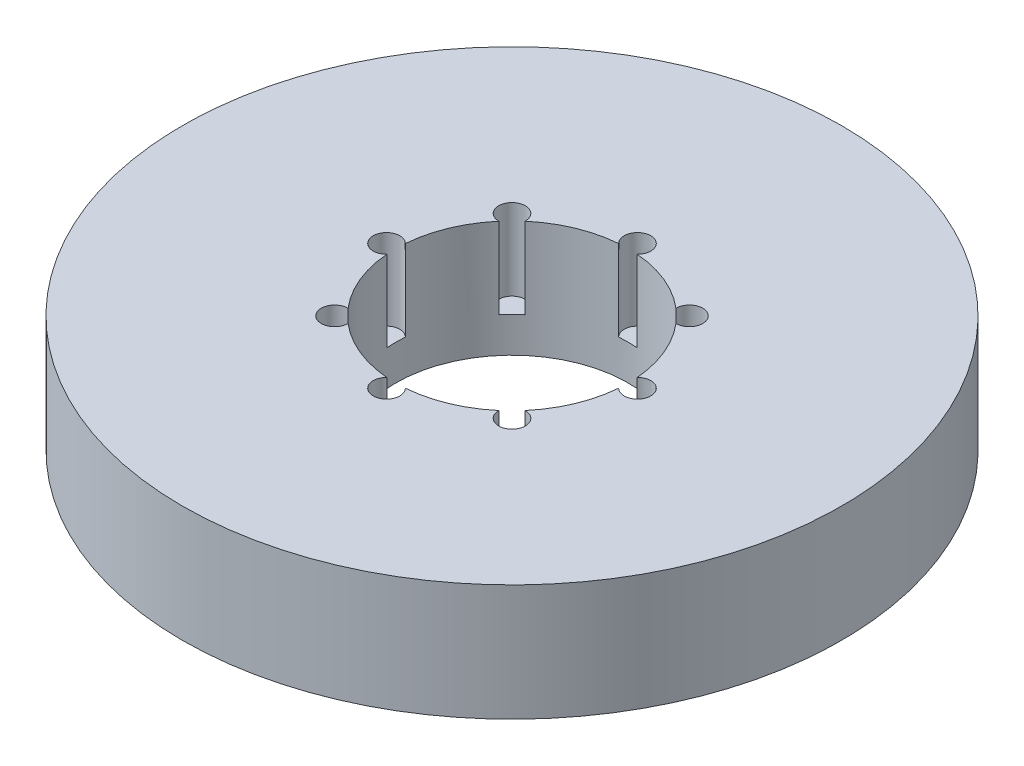
ISO-10303-21;
HEADER;
FILE_DESCRIPTION(('STEP AP214'),'2;1');
FILE_NAME('part.step','',(''),(''),'','','');
FILE_SCHEMA(('AUTOMOTIVE_DESIGN { 1 0 10303 214 1 1 1 1 }'));
ENDSEC;
DATA;
#1=APPLICATION_CONTEXT('core data for automotive mechanical design processes');
#2=APPLICATION_PROTOCOL_DEFINITION('international standard','automotive_design',2000,#1);
#3=PRODUCT_CONTEXT('',#1,'mechanical');
#4=PRODUCT('Part','Part','',(#3));
#5=PRODUCT_RELATED_PRODUCT_CATEGORY('part','',(#4));
#6=PRODUCT_DEFINITION_FORMATION('','',#4);
#7=PRODUCT_DEFINITION_CONTEXT('part definition',#1,'design');
#8=PRODUCT_DEFINITION('design','',#6,#7);
#9=PRODUCT_DEFINITION_SHAPE('','',#8);
#10=(LENGTH_UNIT() NAMED_UNIT(*) SI_UNIT(.MILLI.,.METRE.));
#11=(NAMED_UNIT(*) PLANE_ANGLE_UNIT() SI_UNIT($,.RADIAN.));
#12=(NAMED_UNIT(*) SI_UNIT($,.STERADIAN.) SOLID_ANGLE_UNIT());
#13=UNCERTAINTY_MEASURE_WITH_UNIT(LENGTH_MEASURE(1.E-05),#10,'distance_accuracy_value','');
#14=(GEOMETRIC_REPRESENTATION_CONTEXT(3) GLOBAL_UNCERTAINTY_ASSIGNED_CONTEXT((#13)) GLOBAL_UNIT_ASSIGNED_CONTEXT((#10,
#11,#12)) REPRESENTATION_CONTEXT('',''));
#15=CARTESIAN_POINT('',(0.,0.,0.));
#16=DIRECTION('',(0.,0.,1.));
#17=DIRECTION('',(1.,0.,0.));
#18=AXIS2_PLACEMENT_3D('',#15,#16,#17);
#19=CARTESIAN_POINT('',(0.,30.,0.));
#20=DIRECTION('',(0.,-1.,0.));
#21=DIRECTION('',(0.,0.,-1.));
#22=AXIS2_PLACEMENT_3D('',#19,#20,#21);
#23=CYLINDRICAL_SURFACE('',#22,85.);
#24=CARTESIAN_POINT('',(0.,30.,0.));
#25=DIRECTION('',(0.,1.,0.));
#26=DIRECTION('',(0.,0.,1.));
#27=AXIS2_PLACEMENT_3D('',#24,#25,#26);
#28=CIRCLE('',#27,85.);
#29=CARTESIAN_POINT('',(0.,30.,85.));
#30=VERTEX_POINT('',#29);
#31=EDGE_CURVE('E195',#30,#30,#28,.T.);
#32=ORIENTED_EDGE('',*,*,#31,.F.);
#33=EDGE_LOOP('',(#32));
#34=FACE_BOUND('',#33,.T.);
#35=CARTESIAN_POINT('',(0.,0.,0.));
#36=DIRECTION('',(0.,1.,0.));
#37=DIRECTION('',(0.,0.,1.));
#38=AXIS2_PLACEMENT_3D('',#35,#36,#37);
#39=CIRCLE('',#38,85.);
#40=CARTESIAN_POINT('',(0.,0.,85.));
#41=VERTEX_POINT('',#40);
#42=EDGE_CURVE('E179',#41,#41,#39,.T.);
#43=ORIENTED_EDGE('',*,*,#42,.T.);
#44=EDGE_LOOP('',(#43));
#45=FACE_BOUND('',#44,.T.);
#46=ADVANCED_FACE('F39',(#34,#45),#23,.T.);
#47=CARTESIAN_POINT('',(0.,30.,0.));
#48=DIRECTION('',(0.,1.,0.));
#49=DIRECTION('',(0.,0.,1.));
#50=AXIS2_PLACEMENT_3D('',#47,#48,#49);
#51=PLANE('',#50);
#52=CARTESIAN_POINT('',(1.13000187914397E-13,30.,32.3645401329394));
#53=DIRECTION('',(0.,1.,0.));
#54=DIRECTION('',(1.,0.,0.));
#55=AXIS2_PLACEMENT_3D('',#52,#53,#54);
#56=CIRCLE('',#55,3.43145850614087);
#57=CARTESIAN_POINT('',(-2.39226681175299,30.,29.9044655444866));
#58=VERTEX_POINT('',#57);
#59=CARTESIAN_POINT('',(2.3922668117532,30.,29.9044655444866));
#60=VERTEX_POINT('',#59);
#61=EDGE_CURVE('E176',#58,#60,#56,.T.);
#62=ORIENTED_EDGE('',*,*,#61,.F.);
#63=CARTESIAN_POINT('',(0.,30.,0.));
#64=DIRECTION('',(0.,1.,0.));
#65=DIRECTION('',(0.,0.,1.));
#66=AXIS2_PLACEMENT_3D('',#63,#64,#65);
#67=CIRCLE('',#66,30.);
#68=CARTESIAN_POINT('',(-19.4540622892677,30.,22.8372384592641));
#69=VERTEX_POINT('',#68);
#70=EDGE_CURVE('E166',#69,#58,#67,.T.);
#71=ORIENTED_EDGE('',*,*,#70,.F.);
#72=CARTESIAN_POINT('',(-22.8851857979856,30.,22.8851857979856));
#73=DIRECTION('',(0.,1.,0.));
#74=DIRECTION('',(0.707106781186549,0.,0.707106781186546));
#75=AXIS2_PLACEMENT_3D('',#72,#73,#74);
#76=CIRCLE('',#75,3.43145850614087);
#77=CARTESIAN_POINT('',(-22.837238459264,30.,19.4540622892678));
#78=VERTEX_POINT('',#77);
#79=EDGE_CURVE('E147',#78,#69,#76,.T.);
#80=ORIENTED_EDGE('',*,*,#79,.F.);
#81=CARTESIAN_POINT('',(-29.9044655444866,30.,2.3922668117531));
#82=VERTEX_POINT('',#81);
#83=EDGE_CURVE('E180',#82,#78,#67,.T.);
#84=ORIENTED_EDGE('',*,*,#83,.F.);
#85=CARTESIAN_POINT('',(-32.3645401329394,30.,0.));
#86=DIRECTION('',(0.,1.,0.));
#87=DIRECTION('',(0.,0.,1.));
#88=AXIS2_PLACEMENT_3D('',#85,#86,#87);
#89=CIRCLE('',#88,3.43145850614087);
#90=CARTESIAN_POINT('',(-29.9044655444866,30.,-2.3922668117531));
#91=VERTEX_POINT('',#90);
#92=EDGE_CURVE('E186',#91,#82,#89,.T.);
#93=ORIENTED_EDGE('',*,*,#92,.F.);
#94=CARTESIAN_POINT('',(-22.8372384592643,30.,-19.4540622892675));
#95=VERTEX_POINT('',#94);
#96=EDGE_CURVE('E182',#95,#91,#67,.T.);
#97=ORIENTED_EDGE('',*,*,#96,.F.);
#98=CARTESIAN_POINT('',(-22.8851857979859,30.,-22.8851857979853));
#99=DIRECTION('',(0.,1.,0.));
#100=DIRECTION('',(-0.707106781186539,0.,0.707106781186556));
#101=AXIS2_PLACEMENT_3D('',#98,#99,#100);
#102=CIRCLE('',#101,3.43145850614087);
#103=CARTESIAN_POINT('',(-19.4540622892681,30.,-22.8372384592638));
#104=VERTEX_POINT('',#103);
#105=EDGE_CURVE('E446',#104,#95,#102,.T.);
#106=ORIENTED_EDGE('',*,*,#105,.F.);
#107=CARTESIAN_POINT('',(-2.39226681175341,30.,-29.9044655444865));
#108=VERTEX_POINT('',#107);
#109=EDGE_CURVE('E452',#108,#104,#67,.T.);
#110=ORIENTED_EDGE('',*,*,#109,.F.);
#111=CARTESIAN_POINT('',(-3.39000563743192E-13,30.,-32.3645401329394));
#112=DIRECTION('',(0.,1.,0.));
#113=DIRECTION('',(-1.,0.,0.));
#114=AXIS2_PLACEMENT_3D('',#111,#112,#113);
#115=CIRCLE('',#114,3.43145850614087);
#116=CARTESIAN_POINT('',(2.39226681175278,30.,-29.9044655444866));
#117=VERTEX_POINT('',#116);
#118=EDGE_CURVE('E477',#117,#108,#115,.T.);
#119=ORIENTED_EDGE('',*,*,#118,.F.);
#120=CARTESIAN_POINT('',(19.4540622892676,30.,-22.8372384592642));
#121=VERTEX_POINT('',#120);
#122=EDGE_CURVE('E460',#121,#117,#67,.T.);
#123=ORIENTED_EDGE('',*,*,#122,.F.);
#124=CARTESIAN_POINT('',(22.8851857979854,30.,-22.8851857979858));
#125=DIRECTION('',(0.,1.,0.));
#126=DIRECTION('',(-0.707106781186554,0.,-0.707106781186541));
#127=AXIS2_PLACEMENT_3D('',#124,#125,#126);
#128=CIRCLE('',#127,3.43145850614087);
#129=CARTESIAN_POINT('',(22.8372384592639,30.,-19.454062289268));
#130=VERTEX_POINT('',#129);
#131=EDGE_CURVE('E464',#130,#121,#128,.T.);
#132=ORIENTED_EDGE('',*,*,#131,.F.);
#133=CARTESIAN_POINT('',(29.9044655444866,30.,-2.3922668117531));
#134=VERTEX_POINT('',#133);
#135=EDGE_CURVE('E459',#134,#130,#67,.T.);
#136=ORIENTED_EDGE('',*,*,#135,.F.);
#137=CARTESIAN_POINT('',(32.3645401329394,30.,0.));
#138=DIRECTION('',(0.,1.,0.));
#139=DIRECTION('',(0.,0.,-1.));
#140=AXIS2_PLACEMENT_3D('',#137,#138,#139);
#141=CIRCLE('',#140,3.43145850614087);
#142=CARTESIAN_POINT('',(29.9044655444866,30.,2.3922668117531));
#143=VERTEX_POINT('',#142);
#144=EDGE_CURVE('E469',#143,#134,#141,.T.);
#145=ORIENTED_EDGE('',*,*,#144,.F.);
#146=CARTESIAN_POINT('',(22.8372384592642,30.,19.4540622892677));
#147=VERTEX_POINT('',#146);
#148=EDGE_CURVE('E181',#147,#143,#67,.T.);
#149=ORIENTED_EDGE('',*,*,#148,.F.);
#150=CARTESIAN_POINT('',(22.8851857979857,30.,22.8851857979855));
#151=DIRECTION('',(0.,1.,0.));
#152=DIRECTION('',(0.707106781186544,0.,-0.707106781186551));
#153=AXIS2_PLACEMENT_3D('',#150,#151,#152);
#154=CIRCLE('',#153,3.43145850614087);
#155=CARTESIAN_POINT('',(19.4540622892679,30.,22.837238459264));
#156=VERTEX_POINT('',#155);
#157=EDGE_CURVE('E475',#156,#147,#154,.T.);
#158=ORIENTED_EDGE('',*,*,#157,.F.);
#159=EDGE_CURVE('E177',#60,#156,#67,.T.);
#160=ORIENTED_EDGE('',*,*,#159,.F.);
#161=EDGE_LOOP('',(#62,#71,#80,#84,#93,#97,#106,#110,#119,#123,#132,#136,#145,#149,#158,#160));
#162=FACE_BOUND('',#161,.T.);
#163=ORIENTED_EDGE('',*,*,#31,.T.);
#164=EDGE_LOOP('',(#163));
#165=FACE_BOUND('',#164,.T.);
#166=ADVANCED_FACE('F172',(#162,#165),#51,.T.);
#167=CARTESIAN_POINT('',(0.,0.,0.));
#168=DIRECTION('',(0.,1.,0.));
#169=DIRECTION('',(0.,0.,1.));
#170=AXIS2_PLACEMENT_3D('',#167,#168,#169);
#171=PLANE('',#170);
#172=CARTESIAN_POINT('',(0.,0.,0.));
#173=DIRECTION('',(0.,1.,0.));
#174=DIRECTION('',(0.,0.,1.));
#175=AXIS2_PLACEMENT_3D('',#172,#173,#174);
#176=CIRCLE('',#175,30.);
#177=CARTESIAN_POINT('',(0.,0.,30.));
#178=VERTEX_POINT('',#177);
#179=EDGE_CURVE('E187',#178,#178,#176,.T.);
#180=ORIENTED_EDGE('',*,*,#179,.T.);
#181=EDGE_LOOP('',(#180));
#182=FACE_BOUND('',#181,.T.);
#183=ORIENTED_EDGE('',*,*,#42,.F.);
#184=EDGE_LOOP('',(#183));
#185=FACE_BOUND('',#184,.T.);
#186=ADVANCED_FACE('F270',(#182,#185),#171,.F.);
#187=CARTESIAN_POINT('',(0.,30.,0.));
#188=DIRECTION('',(0.,-1.,0.));
#189=DIRECTION('',(0.,0.,-1.));
#190=AXIS2_PLACEMENT_3D('',#187,#188,#189);
#191=CYLINDRICAL_SURFACE('',#190,30.);
#192=DIRECTION('',(0.,1.,0.));
#193=VECTOR('',#192,1.);
#194=CARTESIAN_POINT('',(-2.392266811753,19.5467976115902,29.9044655444866));
#195=LINE('',#194,#193);
#196=CARTESIAN_POINT('',(-2.39226681175299,9.09359522318038,29.9044655444866));
#197=VERTEX_POINT('',#196);
#198=EDGE_CURVE('E11',#197,#58,#195,.T.);
#199=ORIENTED_EDGE('',*,*,#198,.F.);
#200=CARTESIAN_POINT('',(0.,9.09359522318038,0.));
#201=DIRECTION('',(0.,1.,0.));
#202=DIRECTION('',(0.,0.,1.));
#203=AXIS2_PLACEMENT_3D('',#200,#201,#202);
#204=CIRCLE('',#203,30.);
#205=CARTESIAN_POINT('',(2.3922668117532,9.09359522318038,29.9044655444866));
#206=VERTEX_POINT('',#205);
#207=EDGE_CURVE('E250',#197,#206,#204,.T.);
#208=ORIENTED_EDGE('',*,*,#207,.T.);
#209=DIRECTION('',(0.,1.,0.));
#210=VECTOR('',#209,1.);
#211=CARTESIAN_POINT('',(2.39226681175321,19.5467976115902,29.9044655444866));
#212=LINE('',#211,#210);
#213=EDGE_CURVE('E46',#60,#206,#212,.F.);
#214=ORIENTED_EDGE('',*,*,#213,.F.);
#215=ORIENTED_EDGE('',*,*,#159,.T.);
#216=DIRECTION('',(0.,1.,0.));
#217=VECTOR('',#216,1.);
#218=CARTESIAN_POINT('',(19.4540622892679,19.5467976115902,22.837238459264));
#219=LINE('',#218,#217);
#220=CARTESIAN_POINT('',(19.4540622892679,9.09359522318038,22.837238459264));
#221=VERTEX_POINT('',#220);
#222=EDGE_CURVE('E244',#221,#156,#219,.T.);
#223=ORIENTED_EDGE('',*,*,#222,.F.);
#224=CARTESIAN_POINT('',(0.,9.09359522318038,0.));
#225=DIRECTION('',(0.,1.,0.));
#226=DIRECTION('',(0.,0.,1.));
#227=AXIS2_PLACEMENT_3D('',#224,#225,#226);
#228=CIRCLE('',#227,30.);
#229=CARTESIAN_POINT('',(22.8372384592642,9.09359522318038,19.4540622892677));
#230=VERTEX_POINT('',#229);
#231=EDGE_CURVE('E238',#221,#230,#228,.T.);
#232=ORIENTED_EDGE('',*,*,#231,.T.);
#233=DIRECTION('',(0.,1.,0.));
#234=VECTOR('',#233,1.);
#235=CARTESIAN_POINT('',(22.8372384592642,19.5467976115902,19.4540622892677));
#236=LINE('',#235,#234);
#237=EDGE_CURVE('E242',#147,#230,#236,.F.);
#238=ORIENTED_EDGE('',*,*,#237,.F.);
#239=ORIENTED_EDGE('',*,*,#148,.T.);
#240=DIRECTION('',(0.,1.,0.));
#241=VECTOR('',#240,1.);
#242=CARTESIAN_POINT('',(29.9044655444866,19.5467976115902,2.3922668117531));
#243=LINE('',#242,#241);
#244=CARTESIAN_POINT('',(29.9044655444866,9.09359522318038,2.3922668117531));
#245=VERTEX_POINT('',#244);
#246=EDGE_CURVE('E236',#245,#143,#243,.T.);
#247=ORIENTED_EDGE('',*,*,#246,.F.);
#248=CARTESIAN_POINT('',(0.,9.09359522318038,0.));
#249=DIRECTION('',(0.,1.,0.));
#250=DIRECTION('',(0.,0.,1.));
#251=AXIS2_PLACEMENT_3D('',#248,#249,#250);
#252=CIRCLE('',#251,30.);
#253=CARTESIAN_POINT('',(29.9044655444866,9.09359522318038,-2.3922668117531));
#254=VERTEX_POINT('',#253);
#255=EDGE_CURVE('E235',#245,#254,#252,.T.);
#256=ORIENTED_EDGE('',*,*,#255,.T.);
#257=DIRECTION('',(0.,1.,0.));
#258=VECTOR('',#257,1.);
#259=CARTESIAN_POINT('',(29.9044655444866,19.5467976115902,-2.3922668117531));
#260=LINE('',#259,#258);
#261=EDGE_CURVE('E234',#134,#254,#260,.F.);
#262=ORIENTED_EDGE('',*,*,#261,.F.);
#263=ORIENTED_EDGE('',*,*,#135,.T.);
#264=DIRECTION('',(0.,1.,0.));
#265=VECTOR('',#264,1.);
#266=CARTESIAN_POINT('',(22.8372384592639,19.5467976115902,-19.454062289268));
#267=LINE('',#266,#265);
#268=CARTESIAN_POINT('',(22.8372384592639,9.09359522318038,-19.454062289268));
#269=VERTEX_POINT('',#268);
#270=EDGE_CURVE('E229',#269,#130,#267,.T.);
#271=ORIENTED_EDGE('',*,*,#270,.F.);
#272=CARTESIAN_POINT('',(0.,9.09359522318038,0.));
#273=DIRECTION('',(0.,1.,0.));
#274=DIRECTION('',(0.,0.,1.));
#275=AXIS2_PLACEMENT_3D('',#272,#273,#274);
#276=CIRCLE('',#275,30.);
#277=CARTESIAN_POINT('',(19.4540622892676,9.09359522318038,-22.8372384592642));
#278=VERTEX_POINT('',#277);
#279=EDGE_CURVE('E221',#269,#278,#276,.T.);
#280=ORIENTED_EDGE('',*,*,#279,.T.);
#281=DIRECTION('',(0.,1.,0.));
#282=VECTOR('',#281,1.);
#283=CARTESIAN_POINT('',(19.4540622892676,19.5467976115902,-22.8372384592642));
#284=LINE('',#283,#282);
#285=EDGE_CURVE('E230',#121,#278,#284,.F.);
#286=ORIENTED_EDGE('',*,*,#285,.F.);
#287=ORIENTED_EDGE('',*,*,#122,.T.);
#288=DIRECTION('',(0.,1.,0.));
#289=VECTOR('',#288,1.);
#290=CARTESIAN_POINT('',(2.39226681175279,19.5467976115902,-29.9044655444866));
#291=LINE('',#290,#289);
#292=CARTESIAN_POINT('',(2.39226681175278,9.09359522318038,-29.9044655444866));
#293=VERTEX_POINT('',#292);
#294=EDGE_CURVE('E225',#293,#117,#291,.T.);
#295=ORIENTED_EDGE('',*,*,#294,.F.);
#296=CARTESIAN_POINT('',(0.,9.09359522318038,0.));
#297=DIRECTION('',(0.,1.,0.));
#298=DIRECTION('',(0.,0.,1.));
#299=AXIS2_PLACEMENT_3D('',#296,#297,#298);
#300=CIRCLE('',#299,30.);
#301=CARTESIAN_POINT('',(-2.39226681175341,9.09359522318038,-29.9044655444865));
#302=VERTEX_POINT('',#301);
#303=EDGE_CURVE('E216',#293,#302,#300,.T.);
#304=ORIENTED_EDGE('',*,*,#303,.T.);
#305=DIRECTION('',(0.,1.,0.));
#306=VECTOR('',#305,1.);
#307=CARTESIAN_POINT('',(-2.39226681175342,19.5467976115902,-29.9044655444866));
#308=LINE('',#307,#306);
#309=EDGE_CURVE('E218',#108,#302,#308,.F.);
#310=ORIENTED_EDGE('',*,*,#309,.F.);
#311=ORIENTED_EDGE('',*,*,#109,.T.);
#312=DIRECTION('',(0.,1.,0.));
#313=VECTOR('',#312,1.);
#314=CARTESIAN_POINT('',(-19.4540622892681,19.5467976115902,-22.8372384592638));
#315=LINE('',#314,#313);
#316=CARTESIAN_POINT('',(-19.4540622892681,9.09359522318038,-22.8372384592638));
#317=VERTEX_POINT('',#316);
#318=EDGE_CURVE('E212',#317,#104,#315,.T.);
#319=ORIENTED_EDGE('',*,*,#318,.F.);
#320=CARTESIAN_POINT('',(0.,9.09359522318038,0.));
#321=DIRECTION('',(0.,1.,0.));
#322=DIRECTION('',(0.,0.,1.));
#323=AXIS2_PLACEMENT_3D('',#320,#321,#322);
#324=CIRCLE('',#323,30.);
#325=CARTESIAN_POINT('',(-22.8372384592643,9.09359522318038,-19.4540622892675));
#326=VERTEX_POINT('',#325);
#327=EDGE_CURVE('E208',#317,#326,#324,.T.);
#328=ORIENTED_EDGE('',*,*,#327,.T.);
#329=DIRECTION('',(0.,1.,0.));
#330=VECTOR('',#329,1.);
#331=CARTESIAN_POINT('',(-22.8372384592643,19.5467976115902,-19.4540622892675));
#332=LINE('',#331,#330);
#333=EDGE_CURVE('E211',#95,#326,#332,.F.);
#334=ORIENTED_EDGE('',*,*,#333,.F.);
#335=ORIENTED_EDGE('',*,*,#96,.T.);
#336=DIRECTION('',(0.,1.,0.));
#337=VECTOR('',#336,1.);
#338=CARTESIAN_POINT('',(-29.9044655444866,19.5467976115902,-2.3922668117531));
#339=LINE('',#338,#337);
#340=CARTESIAN_POINT('',(-29.9044655444866,9.09359522318038,-2.3922668117531));
#341=VERTEX_POINT('',#340);
#342=EDGE_CURVE('E201',#341,#91,#339,.T.);
#343=ORIENTED_EDGE('',*,*,#342,.F.);
#344=CARTESIAN_POINT('',(0.,9.09359522318038,0.));
#345=DIRECTION('',(0.,1.,0.));
#346=DIRECTION('',(0.,0.,1.));
#347=AXIS2_PLACEMENT_3D('',#344,#345,#346);
#348=CIRCLE('',#347,30.);
#349=CARTESIAN_POINT('',(-29.9044655444866,9.09359522318038,2.3922668117531));
#350=VERTEX_POINT('',#349);
#351=EDGE_CURVE('E194',#341,#350,#348,.T.);
#352=ORIENTED_EDGE('',*,*,#351,.T.);
#353=DIRECTION('',(0.,1.,0.));
#354=VECTOR('',#353,1.);
#355=CARTESIAN_POINT('',(-29.9044655444866,19.5467976115902,2.3922668117531));
#356=LINE('',#355,#354);
#357=EDGE_CURVE('E199',#82,#350,#356,.F.);
#358=ORIENTED_EDGE('',*,*,#357,.F.);
#359=ORIENTED_EDGE('',*,*,#83,.T.);
#360=DIRECTION('',(0.,1.,0.));
#361=VECTOR('',#360,1.);
#362=CARTESIAN_POINT('',(-22.837238459264,19.5467976115902,19.4540622892678));
#363=LINE('',#362,#361);
#364=CARTESIAN_POINT('',(-22.837238459264,9.09359522318038,19.4540622892678));
#365=VERTEX_POINT('',#364);
#366=EDGE_CURVE('E160',#365,#78,#363,.T.);
#367=ORIENTED_EDGE('',*,*,#366,.F.);
#368=CARTESIAN_POINT('',(0.,9.09359522318038,0.));
#369=DIRECTION('',(0.,1.,0.));
#370=DIRECTION('',(0.,0.,1.));
#371=AXIS2_PLACEMENT_3D('',#368,#369,#370);
#372=CIRCLE('',#371,30.);
#373=CARTESIAN_POINT('',(-19.4540622892677,9.09359522318038,22.8372384592641));
#374=VERTEX_POINT('',#373);
#375=EDGE_CURVE('E168',#365,#374,#372,.T.);
#376=ORIENTED_EDGE('',*,*,#375,.T.);
#377=DIRECTION('',(0.,1.,0.));
#378=VECTOR('',#377,1.);
#379=CARTESIAN_POINT('',(-19.4540622892677,19.5467976115902,22.8372384592641));
#380=LINE('',#379,#378);
#381=EDGE_CURVE('E152',#69,#374,#380,.F.);
#382=ORIENTED_EDGE('',*,*,#381,.F.);
#383=ORIENTED_EDGE('',*,*,#70,.T.);
#384=EDGE_LOOP('',(#199,#208,#214,#215,#223,#232,#238,#239,#247,#256,#262,#263,#271,#280,#286,
#287,#295,#304,#310,#311,#319,#328,#334,#335,#343,#352,#358,#359,#367,#376,#382,#383));
#385=FACE_BOUND('',#384,.T.);
#386=ORIENTED_EDGE('',*,*,#179,.F.);
#387=EDGE_LOOP('',(#386));
#388=FACE_BOUND('',#387,.T.);
#389=ADVANCED_FACE('F170',(#385,#388),#191,.F.);
#390=CARTESIAN_POINT('',(-32.3645401329394,9.09359522318038,0.));
#391=DIRECTION('',(0.,1.,0.));
#392=DIRECTION('',(0.,0.,1.));
#393=AXIS2_PLACEMENT_3D('',#390,#391,#392);
#394=CYLINDRICAL_SURFACE('',#393,3.43145850614087);
#395=ORIENTED_EDGE('',*,*,#342,.T.);
#396=ORIENTED_EDGE('',*,*,#92,.T.);
#397=ORIENTED_EDGE('',*,*,#357,.T.);
#398=CARTESIAN_POINT('',(-32.3645401329394,9.09359522318038,0.));
#399=DIRECTION('',(0.,1.,0.));
#400=DIRECTION('',(0.,0.,1.));
#401=AXIS2_PLACEMENT_3D('',#398,#399,#400);
#402=CIRCLE('',#401,3.43145850614087);
#403=EDGE_CURVE('E191',#341,#350,#402,.T.);
#404=ORIENTED_EDGE('',*,*,#403,.F.);
#405=EDGE_LOOP('',(#395,#396,#397,#404));
#406=FACE_BOUND('',#405,.T.);
#407=ADVANCED_FACE('F279',(#406),#394,.F.);
#408=CARTESIAN_POINT('',(-32.3645401329394,9.09359522318038,0.));
#409=DIRECTION('',(0.,1.,0.));
#410=DIRECTION('',(0.,0.,1.));
#411=AXIS2_PLACEMENT_3D('',#408,#409,#410);
#412=PLANE('',#411);
#413=ORIENTED_EDGE('',*,*,#403,.T.);
#414=ORIENTED_EDGE('',*,*,#351,.F.);
#415=EDGE_LOOP('',(#413,#414));
#416=FACE_BOUND('',#415,.T.);
#417=ADVANCED_FACE('F285',(#416),#412,.T.);
#418=CARTESIAN_POINT('',(-22.8851857979856,9.09359522318038,22.8851857979856));
#419=DIRECTION('',(0.,1.,0.));
#420=DIRECTION('',(0.,0.,1.));
#421=AXIS2_PLACEMENT_3D('',#418,#419,#420);
#422=CYLINDRICAL_SURFACE('',#421,3.43145850614087);
#423=ORIENTED_EDGE('',*,*,#366,.T.);
#424=ORIENTED_EDGE('',*,*,#79,.T.);
#425=ORIENTED_EDGE('',*,*,#381,.T.);
#426=CARTESIAN_POINT('',(-22.8851857979856,9.09359522318038,22.8851857979856));
#427=DIRECTION('',(0.,1.,0.));
#428=DIRECTION('',(0.707106781186549,0.,0.707106781186546));
#429=AXIS2_PLACEMENT_3D('',#426,#427,#428);
#430=CIRCLE('',#429,3.43145850614087);
#431=EDGE_CURVE('E165',#365,#374,#430,.T.);
#432=ORIENTED_EDGE('',*,*,#431,.F.);
#433=EDGE_LOOP('',(#423,#424,#425,#432));
#434=FACE_BOUND('',#433,.T.);
#435=ADVANCED_FACE('F155',(#434),#422,.F.);
#436=CARTESIAN_POINT('',(-22.8851857979856,9.09359522318038,22.8851857979856));
#437=DIRECTION('',(0.,1.,0.));
#438=DIRECTION('',(0.707106781186549,0.,0.707106781186546));
#439=AXIS2_PLACEMENT_3D('',#436,#437,#438);
#440=PLANE('',#439);
#441=ORIENTED_EDGE('',*,*,#431,.T.);
#442=ORIENTED_EDGE('',*,*,#375,.F.);
#443=EDGE_LOOP('',(#441,#442));
#444=FACE_BOUND('',#443,.T.);
#445=ADVANCED_FACE('F288',(#444),#440,.T.);
#446=CARTESIAN_POINT('',(-22.8851857979859,9.09359522318038,-22.8851857979853));
#447=DIRECTION('',(0.,1.,0.));
#448=DIRECTION('',(0.,0.,1.));
#449=AXIS2_PLACEMENT_3D('',#446,#447,#448);
#450=CYLINDRICAL_SURFACE('',#449,3.43145850614087);
#451=ORIENTED_EDGE('',*,*,#318,.T.);
#452=ORIENTED_EDGE('',*,*,#105,.T.);
#453=ORIENTED_EDGE('',*,*,#333,.T.);
#454=CARTESIAN_POINT('',(-22.8851857979859,9.09359522318038,-22.8851857979853));
#455=DIRECTION('',(0.,1.,0.));
#456=DIRECTION('',(-0.707106781186539,0.,0.707106781186556));
#457=AXIS2_PLACEMENT_3D('',#454,#455,#456);
#458=CIRCLE('',#457,3.43145850614087);
#459=EDGE_CURVE('E447',#317,#326,#458,.T.);
#460=ORIENTED_EDGE('',*,*,#459,.F.);
#461=EDGE_LOOP('',(#451,#452,#453,#460));
#462=FACE_BOUND('',#461,.T.);
#463=ADVANCED_FACE('F295',(#462),#450,.F.);
#464=CARTESIAN_POINT('',(-22.8851857979859,9.09359522318038,-22.8851857979853));
#465=DIRECTION('',(0.,1.,0.));
#466=DIRECTION('',(-0.707106781186539,0.,0.707106781186556));
#467=AXIS2_PLACEMENT_3D('',#464,#465,#466);
#468=PLANE('',#467);
#469=ORIENTED_EDGE('',*,*,#459,.T.);
#470=ORIENTED_EDGE('',*,*,#327,.F.);
#471=EDGE_LOOP('',(#469,#470));
#472=FACE_BOUND('',#471,.T.);
#473=ADVANCED_FACE('F375',(#472),#468,.T.);
#474=CARTESIAN_POINT('',(-3.39000563743192E-13,9.09359522318038,-32.3645401329394));
#475=DIRECTION('',(0.,1.,0.));
#476=DIRECTION('',(0.,0.,1.));
#477=AXIS2_PLACEMENT_3D('',#474,#475,#476);
#478=CYLINDRICAL_SURFACE('',#477,3.43145850614087);
#479=ORIENTED_EDGE('',*,*,#294,.T.);
#480=ORIENTED_EDGE('',*,*,#118,.T.);
#481=ORIENTED_EDGE('',*,*,#309,.T.);
#482=CARTESIAN_POINT('',(-3.39000563743192E-13,9.09359522318038,-32.3645401329394));
#483=DIRECTION('',(0.,1.,0.));
#484=DIRECTION('',(-1.,0.,0.));
#485=AXIS2_PLACEMENT_3D('',#482,#483,#484);
#486=CIRCLE('',#485,3.43145850614087);
#487=EDGE_CURVE('E467',#293,#302,#486,.T.);
#488=ORIENTED_EDGE('',*,*,#487,.F.);
#489=EDGE_LOOP('',(#479,#480,#481,#488));
#490=FACE_BOUND('',#489,.T.);
#491=ADVANCED_FACE('F361',(#490),#478,.F.);
#492=CARTESIAN_POINT('',(-3.39000563743192E-13,9.09359522318038,-32.3645401329394));
#493=DIRECTION('',(0.,1.,0.));
#494=DIRECTION('',(-1.,0.,0.));
#495=AXIS2_PLACEMENT_3D('',#492,#493,#494);
#496=PLANE('',#495);
#497=ORIENTED_EDGE('',*,*,#487,.T.);
#498=ORIENTED_EDGE('',*,*,#303,.F.);
#499=EDGE_LOOP('',(#497,#498));
#500=FACE_BOUND('',#499,.T.);
#501=ADVANCED_FACE('F297',(#500),#496,.T.);
#502=CARTESIAN_POINT('',(22.8851857979854,9.09359522318038,-22.8851857979858));
#503=DIRECTION('',(0.,1.,0.));
#504=DIRECTION('',(0.,0.,1.));
#505=AXIS2_PLACEMENT_3D('',#502,#503,#504);
#506=CYLINDRICAL_SURFACE('',#505,3.43145850614087);
#507=ORIENTED_EDGE('',*,*,#270,.T.);
#508=ORIENTED_EDGE('',*,*,#131,.T.);
#509=ORIENTED_EDGE('',*,*,#285,.T.);
#510=CARTESIAN_POINT('',(22.8851857979854,9.09359522318038,-22.8851857979858));
#511=DIRECTION('',(0.,1.,0.));
#512=DIRECTION('',(-0.707106781186554,0.,-0.707106781186541));
#513=AXIS2_PLACEMENT_3D('',#510,#511,#512);
#514=CIRCLE('',#513,3.43145850614087);
#515=EDGE_CURVE('E470',#269,#278,#514,.T.);
#516=ORIENTED_EDGE('',*,*,#515,.F.);
#517=EDGE_LOOP('',(#507,#508,#509,#516));
#518=FACE_BOUND('',#517,.T.);
#519=ADVANCED_FACE('F294',(#518),#506,.F.);
#520=CARTESIAN_POINT('',(22.8851857979854,9.09359522318038,-22.8851857979858));
#521=DIRECTION('',(0.,1.,0.));
#522=DIRECTION('',(-0.707106781186554,0.,-0.707106781186541));
#523=AXIS2_PLACEMENT_3D('',#520,#521,#522);
#524=PLANE('',#523);
#525=ORIENTED_EDGE('',*,*,#515,.T.);
#526=ORIENTED_EDGE('',*,*,#279,.F.);
#527=EDGE_LOOP('',(#525,#526));
#528=FACE_BOUND('',#527,.T.);
#529=ADVANCED_FACE('F300',(#528),#524,.T.);
#530=CARTESIAN_POINT('',(32.3645401329394,9.09359522318038,0.));
#531=DIRECTION('',(0.,1.,0.));
#532=DIRECTION('',(0.,0.,1.));
#533=AXIS2_PLACEMENT_3D('',#530,#531,#532);
#534=CYLINDRICAL_SURFACE('',#533,3.43145850614087);
#535=ORIENTED_EDGE('',*,*,#246,.T.);
#536=ORIENTED_EDGE('',*,*,#144,.T.);
#537=ORIENTED_EDGE('',*,*,#261,.T.);
#538=CARTESIAN_POINT('',(32.3645401329394,9.09359522318038,0.));
#539=DIRECTION('',(0.,1.,0.));
#540=DIRECTION('',(0.,0.,-1.));
#541=AXIS2_PLACEMENT_3D('',#538,#539,#540);
#542=CIRCLE('',#541,3.43145850614087);
#543=EDGE_CURVE('E472',#245,#254,#542,.T.);
#544=ORIENTED_EDGE('',*,*,#543,.F.);
#545=EDGE_LOOP('',(#535,#536,#537,#544));
#546=FACE_BOUND('',#545,.T.);
#547=ADVANCED_FACE('F305',(#546),#534,.F.);
#548=CARTESIAN_POINT('',(32.3645401329394,9.09359522318038,0.));
#549=DIRECTION('',(0.,1.,0.));
#550=DIRECTION('',(0.,0.,-1.));
#551=AXIS2_PLACEMENT_3D('',#548,#549,#550);
#552=PLANE('',#551);
#553=ORIENTED_EDGE('',*,*,#543,.T.);
#554=ORIENTED_EDGE('',*,*,#255,.F.);
#555=EDGE_LOOP('',(#553,#554));
#556=FACE_BOUND('',#555,.T.);
#557=ADVANCED_FACE('F308',(#556),#552,.T.);
#558=CARTESIAN_POINT('',(22.8851857979857,9.09359522318038,22.8851857979855));
#559=DIRECTION('',(0.,1.,0.));
#560=DIRECTION('',(0.,0.,1.));
#561=AXIS2_PLACEMENT_3D('',#558,#559,#560);
#562=CYLINDRICAL_SURFACE('',#561,3.43145850614087);
#563=ORIENTED_EDGE('',*,*,#222,.T.);
#564=ORIENTED_EDGE('',*,*,#157,.T.);
#565=ORIENTED_EDGE('',*,*,#237,.T.);
#566=CARTESIAN_POINT('',(22.8851857979857,9.09359522318038,22.8851857979855));
#567=DIRECTION('',(0.,1.,0.));
#568=DIRECTION('',(0.707106781186544,0.,-0.707106781186551));
#569=AXIS2_PLACEMENT_3D('',#566,#567,#568);
#570=CIRCLE('',#569,3.43145850614087);
#571=EDGE_CURVE('E56',#221,#230,#570,.T.);
#572=ORIENTED_EDGE('',*,*,#571,.F.);
#573=EDGE_LOOP('',(#563,#564,#565,#572));
#574=FACE_BOUND('',#573,.T.);
#575=ADVANCED_FACE('F309',(#574),#562,.F.);
#576=CARTESIAN_POINT('',(22.8851857979857,9.09359522318038,22.8851857979855));
#577=DIRECTION('',(0.,1.,0.));
#578=DIRECTION('',(0.707106781186544,0.,-0.707106781186551));
#579=AXIS2_PLACEMENT_3D('',#576,#577,#578);
#580=PLANE('',#579);
#581=ORIENTED_EDGE('',*,*,#571,.T.);
#582=ORIENTED_EDGE('',*,*,#231,.F.);
#583=EDGE_LOOP('',(#581,#582));
#584=FACE_BOUND('',#583,.T.);
#585=ADVANCED_FACE('F256',(#584),#580,.T.);
#586=CARTESIAN_POINT('',(1.13000187914397E-13,9.09359522318038,32.3645401329394));
#587=DIRECTION('',(0.,1.,0.));
#588=DIRECTION('',(0.,0.,1.));
#589=AXIS2_PLACEMENT_3D('',#586,#587,#588);
#590=CYLINDRICAL_SURFACE('',#589,3.43145850614087);
#591=ORIENTED_EDGE('',*,*,#198,.T.);
#592=ORIENTED_EDGE('',*,*,#61,.T.);
#593=ORIENTED_EDGE('',*,*,#213,.T.);
#594=CARTESIAN_POINT('',(1.13000187914397E-13,9.09359522318038,32.3645401329394));
#595=DIRECTION('',(0.,1.,0.));
#596=DIRECTION('',(1.,0.,0.));
#597=AXIS2_PLACEMENT_3D('',#594,#595,#596);
#598=CIRCLE('',#597,3.43145850614087);
#599=EDGE_CURVE('E55',#197,#206,#598,.T.);
#600=ORIENTED_EDGE('',*,*,#599,.F.);
#601=EDGE_LOOP('',(#591,#592,#593,#600));
#602=FACE_BOUND('',#601,.T.);
#603=ADVANCED_FACE('F253',(#602),#590,.F.);
#604=CARTESIAN_POINT('',(1.13000187914397E-13,9.09359522318038,32.3645401329394));
#605=DIRECTION('',(0.,1.,0.));
#606=DIRECTION('',(1.,0.,0.));
#607=AXIS2_PLACEMENT_3D('',#604,#605,#606);
#608=PLANE('',#607);
#609=ORIENTED_EDGE('',*,*,#599,.T.);
#610=ORIENTED_EDGE('',*,*,#207,.F.);
#611=EDGE_LOOP('',(#609,#610));
#612=FACE_BOUND('',#611,.T.);
#613=ADVANCED_FACE('F252',(#612),#608,.T.);
#614=CLOSED_SHELL('',(#46,#166,#186,#389,#407,#417,#435,#445,#463,#473,#491,#501,#519,#529,#547,
#557,#575,#585,#603,#613));
#615=MANIFOLD_SOLID_BREP('B2',#614);
#616=ADVANCED_BREP_SHAPE_REPRESENTATION('',(#18,#615),#14);
#617=SHAPE_DEFINITION_REPRESENTATION(#9,#616);
ENDSEC;
END-ISO-10303-21;
